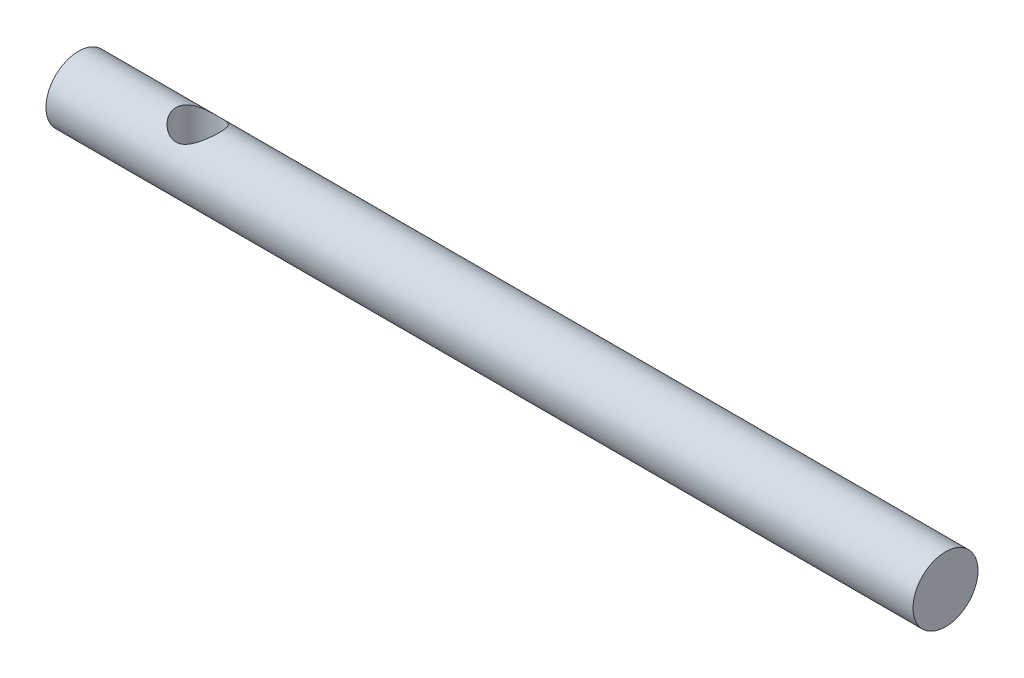
ISO-10303-21;
HEADER;
FILE_DESCRIPTION(('STEP AP214'),'2;1');
FILE_NAME('part.step','',(''),(''),'','','');
FILE_SCHEMA(('AUTOMOTIVE_DESIGN { 1 0 10303 214 1 1 1 1 }'));
ENDSEC;
DATA;
#1=APPLICATION_CONTEXT('core data for automotive mechanical design processes');
#2=APPLICATION_PROTOCOL_DEFINITION('international standard','automotive_design',2000,#1);
#3=PRODUCT_CONTEXT('',#1,'mechanical');
#4=PRODUCT('Part','Part','',(#3));
#5=PRODUCT_RELATED_PRODUCT_CATEGORY('part','',(#4));
#6=PRODUCT_DEFINITION_FORMATION('','',#4);
#7=PRODUCT_DEFINITION_CONTEXT('part definition',#1,'design');
#8=PRODUCT_DEFINITION('design','',#6,#7);
#9=PRODUCT_DEFINITION_SHAPE('','',#8);
#10=(LENGTH_UNIT() NAMED_UNIT(*) SI_UNIT(.MILLI.,.METRE.));
#11=(NAMED_UNIT(*) PLANE_ANGLE_UNIT() SI_UNIT($,.RADIAN.));
#12=(NAMED_UNIT(*) SI_UNIT($,.STERADIAN.) SOLID_ANGLE_UNIT());
#13=UNCERTAINTY_MEASURE_WITH_UNIT(LENGTH_MEASURE(1.E-05),#10,'distance_accuracy_value','');
#14=(GEOMETRIC_REPRESENTATION_CONTEXT(3) GLOBAL_UNCERTAINTY_ASSIGNED_CONTEXT((#13)) GLOBAL_UNIT_ASSIGNED_CONTEXT((#10,
#11,#12)) REPRESENTATION_CONTEXT('',''));
#15=CARTESIAN_POINT('',(0.,0.,0.));
#16=DIRECTION('',(0.,0.,1.));
#17=DIRECTION('',(1.,0.,0.));
#18=AXIS2_PLACEMENT_3D('',#15,#16,#17);
#19=CARTESIAN_POINT('',(40.,0.,0.));
#20=DIRECTION('',(-1.,0.,0.));
#21=DIRECTION('',(0.,0.,1.));
#22=AXIS2_PLACEMENT_3D('',#19,#20,#21);
#23=CYLINDRICAL_SURFACE('',#22,1.5);
#24=CARTESIAN_POINT('',(4.5,-1.5,0.));
#25=CARTESIAN_POINT('',(4.49999972518375,-1.50000020822414,0.050242358334064));
#26=CARTESIAN_POINT('',(4.50380698497775,-1.49745401376693,0.100484543566457));
#27=CARTESIAN_POINT('',(4.51879843205283,-1.48752326211906,0.199366529015833));
#28=CARTESIAN_POINT('',(4.52998612156165,-1.48013640790618,0.248005556977501));
#29=CARTESIAN_POINT('',(4.55905385866242,-1.46125241202354,0.342106153927126));
#30=CARTESIAN_POINT('',(4.57690257000397,-1.44977452746657,0.387581436328777));
#31=CARTESIAN_POINT('',(4.61853168163575,-1.4236306893872,0.474707645498629));
#32=CARTESIAN_POINT('',(4.64231294315028,-1.40896427302755,0.516358015804834));
#33=CARTESIAN_POINT('',(4.69732846868371,-1.37613664684919,0.598642350385054));
#34=CARTESIAN_POINT('',(4.72902393037145,-1.3577844878966,0.638890152730337));
#35=CARTESIAN_POINT('',(4.79786502432922,-1.31991156541733,0.713864022346369));
#36=CARTESIAN_POINT('',(4.83501846491887,-1.30038915178416,0.748582027719439));
#37=CARTESIAN_POINT('',(4.92052618380634,-1.25864132339397,0.81711148872748));
#38=CARTESIAN_POINT('',(4.96972282660172,-1.23647533968899,0.849915931813755));
#39=CARTESIAN_POINT('',(5.07418168882327,-1.19542073676408,0.906751785070868));
#40=CARTESIAN_POINT('',(5.12943320078139,-1.17652647977327,0.930798367132494));
#41=CARTESIAN_POINT('',(5.2283556467108,-1.14988133320735,0.963370175057203));
#42=CARTESIAN_POINT('',(5.27076422643691,-1.14048813946218,0.974372236180082));
#43=CARTESIAN_POINT('',(5.35737225237087,-1.12628984829786,0.9907530889261));
#44=CARTESIAN_POINT('',(5.40156847436319,-1.12147684372013,0.99614157325966));
#45=CARTESIAN_POINT('',(5.49073738942807,-1.11718302804083,1.00095682070629));
#46=CARTESIAN_POINT('',(5.5357125117256,-1.11772401279478,1.0003592145882));
#47=CARTESIAN_POINT('',(5.62481748675048,-1.12409887741485,0.993187906666195));
#48=CARTESIAN_POINT('',(5.66894659101632,-1.12993724142592,0.986609141899784));
#49=CARTESIAN_POINT('',(5.75323352561879,-1.14563592995791,0.968324971088712));
#50=CARTESIAN_POINT('',(5.79348066796153,-1.15530744165153,0.956858557405003));
#51=CARTESIAN_POINT('',(5.87151184549575,-1.17754811463845,0.929350592909501));
#52=CARTESIAN_POINT('',(5.90929506514863,-1.19011822916388,0.913307536614354));
#53=CARTESIAN_POINT('',(5.98951269764114,-1.21982098202212,0.873369093698318));
#54=CARTESIAN_POINT('',(6.03132995009406,-1.23736158924507,0.848540261643842));
#55=CARTESIAN_POINT('',(6.11069169749191,-1.27345768922483,0.793344802336528));
#56=CARTESIAN_POINT('',(6.14823082883713,-1.29201441370947,0.762971345040336));
#57=CARTESIAN_POINT('',(6.22627127285557,-1.33271671862096,0.689905826559709));
#58=CARTESIAN_POINT('',(6.2656670243557,-1.35477372355024,0.645969691404497));
#59=CARTESIAN_POINT('',(6.33659824725494,-1.39609050337857,0.551003999553807));
#60=CARTESIAN_POINT('',(6.36814107270105,-1.41535288825285,0.499981149675161));
#61=CARTESIAN_POINT('',(6.4167388593142,-1.44572702044166,0.402428913545598));
#62=CARTESIAN_POINT('',(6.43542168167021,-1.45769630582498,0.356978821685239));
#63=CARTESIAN_POINT('',(6.46605246281194,-1.47753859515521,0.263018021968452));
#64=CARTESIAN_POINT('',(6.47800611356591,-1.48541506063844,0.214509939501016));
#65=CARTESIAN_POINT('',(6.4945805826192,-1.49637941078331,0.115492726585946));
#66=CARTESIAN_POINT('',(6.49916973046918,-1.49944661230576,0.0649759059670216));
#67=CARTESIAN_POINT('',(6.50062354428105,-1.50041557482591,-0.0362207596946188));
#68=CARTESIAN_POINT('',(6.49748875024439,-1.49831769692815,-0.0869005930932838));
#69=CARTESIAN_POINT('',(6.48418797221902,-1.48949794712138,-0.183227858602149));
#70=CARTESIAN_POINT('',(6.47453135112234,-1.48311123195135,-0.228978722339657));
#71=CARTESIAN_POINT('',(6.44920215699362,-1.46659224642396,-0.318058196213642));
#72=CARTESIAN_POINT('',(6.4335286245361,-1.45645937873408,-0.361386418785357));
#73=CARTESIAN_POINT('',(6.39567385147732,-1.4324817626467,-0.447332375233223));
#74=CARTESIAN_POINT('',(6.37315592295824,-1.41844935068245,-0.489748092316565));
#75=CARTESIAN_POINT('',(6.32278335502769,-1.38800927805403,-0.570341511977791));
#76=CARTESIAN_POINT('',(6.29492541973703,-1.37160015200651,-0.608516574097257));
#77=CARTESIAN_POINT('',(6.22969606591763,-1.33477273328243,-0.685927227415324));
#78=CARTESIAN_POINT('',(6.19151686994798,-1.31413078406203,-0.724375937862666));
#79=CARTESIAN_POINT('',(6.10944428503593,-1.27285586536854,-0.794669840332393));
#80=CARTESIAN_POINT('',(6.0655469805006,-1.25222291185946,-0.826510468230435));
#81=CARTESIAN_POINT('',(5.9764287935708,-1.21469839506517,-0.880623882794764));
#82=CARTESIAN_POINT('',(5.93163398310014,-1.19763798588661,-0.903478180804395));
#83=CARTESIAN_POINT('',(5.83806367360943,-1.16719487207113,-0.942481068876251));
#84=CARTESIAN_POINT('',(5.7892955308023,-1.1538055628277,-0.958641728453859));
#85=CARTESIAN_POINT('',(5.69771775643295,-1.13466604076532,-0.981179217293119));
#86=CARTESIAN_POINT('',(5.65541409507053,-1.12797499006895,-0.988792987823092));
#87=CARTESIAN_POINT('',(5.56971335933228,-1.11939733222928,-0.998496029624887));
#88=CARTESIAN_POINT('',(5.52631752442676,-1.11750550674066,-1.00059130142516));
#89=CARTESIAN_POINT('',(5.43967847164164,-1.11882100574833,-0.999119609907756));
#90=CARTESIAN_POINT('',(5.39643535931854,-1.12203134956834,-0.995549293852656));
#91=CARTESIAN_POINT('',(5.31132823572851,-1.1330522619864,-0.98298498610997));
#92=CARTESIAN_POINT('',(5.26946614306961,-1.14086896751217,-0.973983758587649));
#93=CARTESIAN_POINT('',(5.17714440678568,-1.1626342196827,-0.947965178356307));
#94=CARTESIAN_POINT('',(5.12736614363046,-1.17766166854602,-0.929450935941992));
#95=CARTESIAN_POINT('',(5.03225658291059,-1.21111080629161,-0.885422631474872));
#96=CARTESIAN_POINT('',(4.98693165103157,-1.22953724861883,-0.859898741785419));
#97=CARTESIAN_POINT('',(4.90035905640316,-1.26808593269726,-0.801991402694656));
#98=CARTESIAN_POINT('',(4.85920062728074,-1.28823293691071,-0.76949154944827));
#99=CARTESIAN_POINT('',(4.78233876087877,-1.32814150773993,-0.698358840177307));
#100=CARTESIAN_POINT('',(4.74663700148759,-1.3479029541764,-0.659724105134949));
#101=CARTESIAN_POINT('',(4.67664394784294,-1.38815775980392,-0.570728664877767));
#102=CARTESIAN_POINT('',(4.64329067991017,-1.40834902724558,-0.519480834775985));
#103=CARTESIAN_POINT('',(4.58604336166801,-1.44388832937518,-0.410434277887487));
#104=CARTESIAN_POINT('',(4.56213444658818,-1.45924396722731,-0.35264603122502));
#105=CARTESIAN_POINT('',(4.52942271091798,-1.48050822418367,-0.245717534917523));
#106=CARTESIAN_POINT('',(4.51844448045066,-1.48775740184446,-0.197506162628865));
#107=CARTESIAN_POINT('',(4.50373598373098,-1.49750140070948,-0.0995290060120643));
#108=CARTESIAN_POINT('',(4.500000272202,-1.49999979375663,-0.0497644180940282));
#109=CARTESIAN_POINT('',(4.5,-1.5,0.));
#110=B_SPLINE_CURVE_WITH_KNOTS('',3,(#24,#25,#26,#27,#28,#29,#30,#31,#32,#33,#34,#35,#36,#37,
#38,#39,#40,#41,#42,#43,#44,#45,#46,#47,#48,#49,#50,#51,#52,#53,#54,#55,#56,#57,#58,#59,#60,#61,
#62,#63,#64,#65,#66,#67,#68,#69,#70,#71,#72,#73,#74,#75,#76,#77,#78,#79,#80,#81,#82,#83,#84,#85,
#86,#87,#88,#89,#90,#91,#92,#93,#94,#95,#96,#97,#98,#99,#100,#101,#102,#103,#104,#105,#106,#107,
#108,#109),.UNSPECIFIED.,.T.,.F.,(4,2,2,2,2,2,2,2,2,2,2,2,2,2,2,2,2,2,2,2,2,2,2,2,2,2,2,2,2,2,2,
2,2,2,2,2,2,2,2,2,2,2,4),(0.,0.1505266132527,0.301124707174344,0.451023076595115,
0.600943219336932,0.763585145002783,0.926462058021592,1.11503341647991,1.30327652722719,
1.43716846838015,1.57082883922904,1.70503355867689,1.83935198631676,1.96774431099011,
2.09617891902539,2.25073787329797,2.40548851889213,2.5935947724756,2.78152420149865,
2.93262043847563,3.08358867570591,3.23520441646309,3.38680955765891,3.5277654239542,
3.66874377568319,3.81826173413942,3.96787227471786,4.1411408806983,4.31452876587063,
4.47324967649701,4.63168313315306,4.76162024003012,4.8914160016149,5.02128860137218,
5.15133461921144,5.31603304346011,5.48096356682587,5.64889622595852,5.81688041978686,
6.00897675773024,6.20076953274023,6.34997645676982,6.49907115623393),.UNSPECIFIED.);
#111=CARTESIAN_POINT('',(4.5,-1.5,0.));
#112=VERTEX_POINT('',#111);
#113=EDGE_CURVE('E10',#112,#112,#110,.T.);
#114=ORIENTED_EDGE('',*,*,#113,.T.);
#115=EDGE_LOOP('',(#114));
#116=FACE_BOUND('',#115,.T.);
#117=CARTESIAN_POINT('',(5.5,1.1180339887499,1.));
#118=CARTESIAN_POINT('',(5.45118584456569,1.11803876731408,0.999997269988655));
#119=CARTESIAN_POINT('',(5.4023546231456,1.12129035523721,0.99639496251832));
#120=CARTESIAN_POINT('',(5.30644004417459,1.13365986250809,0.982291341588654));
#121=CARTESIAN_POINT('',(5.25935998223522,1.14278830406355,0.971777652939311));
#122=CARTESIAN_POINT('',(5.16863227906116,1.16528292912785,0.944679308383159));
#123=CARTESIAN_POINT('',(5.12495615163117,1.17860780897301,0.928153590071069));
#124=CARTESIAN_POINT('',(5.04106708382667,1.20792047340913,0.889670041967691));
#125=CARTESIAN_POINT('',(5.00085486501176,1.22390881079415,0.867711084060814));
#126=CARTESIAN_POINT('',(4.91817655619155,1.25973036466013,0.815012050038568));
#127=CARTESIAN_POINT('',(4.8763339411414,1.27977468045182,0.783437177258661));
#128=CARTESIAN_POINT('',(4.79799864556286,1.31972413654041,0.714096098703399));
#129=CARTESIAN_POINT('',(4.76151123917074,1.33962912148992,0.6763238658854));
#130=CARTESIAN_POINT('',(4.68967817060917,1.38044409261874,0.589078452471477));
#131=CARTESIAN_POINT('',(4.65525874411216,1.40108392923461,0.538703219829095));
#132=CARTESIAN_POINT('',(4.59567895225496,1.43779242241382,0.431235482106116));
#133=CARTESIAN_POINT('',(4.57050824298441,1.45386618115518,0.374150576160852));
#134=CARTESIAN_POINT('',(4.53322179949127,1.47799953732363,0.261624536740001));
#135=CARTESIAN_POINT('',(4.51995832775222,1.48675587807934,0.206717362590708));
#136=CARTESIAN_POINT('',(4.50290775535818,1.49804872730961,0.0948477243649306));
#137=CARTESIAN_POINT('',(4.49910872038728,1.5005930688118,0.0378879406429121));
#138=CARTESIAN_POINT('',(4.50108622497453,1.49927680861477,-0.0670735251161652));
#139=CARTESIAN_POINT('',(4.50549452565853,1.49633132455064,-0.115120319004377));
#140=CARTESIAN_POINT('',(4.52104552567945,1.4860409139501,-0.209619316635508));
#141=CARTESIAN_POINT('',(4.53218871615177,1.47869566656551,-0.256071403824862));
#142=CARTESIAN_POINT('',(4.56059784239729,1.46026045851868,-0.346038968835585));
#143=CARTESIAN_POINT('',(4.57783944259928,1.44918538991339,-0.389565311922981));
#144=CARTESIAN_POINT('',(4.61777682147641,1.42410552238144,-0.473104575326778));
#145=CARTESIAN_POINT('',(4.64047359575076,1.41010018872581,-0.513116852484702));
#146=CARTESIAN_POINT('',(4.69398936872995,1.37809029225351,-0.59414214598172));
#147=CARTESIAN_POINT('',(4.72548376167639,1.35980204396012,-0.634595740498539));
#148=CARTESIAN_POINT('',(4.79394933974016,1.32200300913499,-0.709994037491523));
#149=CARTESIAN_POINT('',(4.83092897296691,1.30249036407615,-0.744930067597285));
#150=CARTESIAN_POINT('',(4.91598160510665,1.26075022472076,-0.813861176630826));
#151=CARTESIAN_POINT('',(4.96488553985724,1.23857160004468,-0.846867965631777));
#152=CARTESIAN_POINT('',(5.06875491961036,1.19737805415546,-0.904174374727408));
#153=CARTESIAN_POINT('',(5.12370999720697,1.17835785767438,-0.928488593274471));
#154=CARTESIAN_POINT('',(5.22235953103654,1.15131435153449,-0.961663622838891));
#155=CARTESIAN_POINT('',(5.2647966850284,1.1417018228885,-0.972953958737704));
#156=CARTESIAN_POINT('',(5.35151974490846,1.1270451989479,-0.989897777900029));
#157=CARTESIAN_POINT('',(5.39580230558647,1.12199318391119,-0.995561034821825));
#158=CARTESIAN_POINT('',(5.48522149322059,1.11723778493745,-1.00089700074453));
#159=CARTESIAN_POINT('',(5.53036098925948,1.11755766933454,-1.00054364876605));
#160=CARTESIAN_POINT('',(5.6198419169781,1.12354940184257,-0.993808148581262));
#161=CARTESIAN_POINT('',(5.66418267205586,1.12922558823607,-0.987421113449806));
#162=CARTESIAN_POINT('',(5.74869470877286,1.14463988751152,-0.969499055937226));
#163=CARTESIAN_POINT('',(5.78896385449378,1.15416593537715,-0.958230872657145));
#164=CARTESIAN_POINT('',(5.86706311803266,1.17614979263984,-0.931115208135282));
#165=CARTESIAN_POINT('',(5.9048924115095,1.18860858636727,-0.915266188999618));
#166=CARTESIAN_POINT('',(5.98510100188837,1.21805741810736,-0.875816733031262));
#167=CARTESIAN_POINT('',(6.02687840563095,1.23545540768822,-0.85130014422603));
#168=CARTESIAN_POINT('',(6.10620840116497,1.27131257456476,-0.796763657645589));
#169=CARTESIAN_POINT('',(6.14375575832942,1.2897730248931,-0.766737059459379));
#170=CARTESIAN_POINT('',(6.22198117378524,1.33037839141598,-0.694383288512647));
#171=CARTESIAN_POINT('',(6.26155142413785,1.35244726064259,-0.650801932557861));
#172=CARTESIAN_POINT('',(6.33290834145647,1.39387790925842,-0.556549744344254));
#173=CARTESIAN_POINT('',(6.36470188562506,1.41324207395941,-0.505885238731676));
#174=CARTESIAN_POINT('',(6.41394586946146,1.44395410620132,-0.408743737408332));
#175=CARTESIAN_POINT('',(6.4329782522209,1.45612729055242,-0.363331182442472));
#176=CARTESIAN_POINT('',(6.46430359715951,1.47639353933783,-0.269378539510944));
#177=CARTESIAN_POINT('',(6.47660225142969,1.48449004936067,-0.220841131929568));
#178=CARTESIAN_POINT('',(6.49384848191957,1.49589182013302,-0.121684696151536));
#179=CARTESIAN_POINT('',(6.49876333975339,1.49917575428247,-0.0710574184621091));
#180=CARTESIAN_POINT('',(6.5008239257085,1.50054910514547,0.030427773290317));
#181=CARTESIAN_POINT('',(6.49797037597807,1.49863900469456,0.0812856654767117));
#182=CARTESIAN_POINT('',(6.48517025549766,1.49014777988657,0.177878766264066));
#183=CARTESIAN_POINT('',(6.4757545075691,1.48391638604927,0.223717571535269));
#184=CARTESIAN_POINT('',(6.45088099528455,1.46768053103468,0.313009211498529));
#185=CARTESIAN_POINT('',(6.43542229232637,1.45767548373552,0.356461674343445));
#186=CARTESIAN_POINT('',(6.39803064755799,1.43395882743097,0.442573648304177));
#187=CARTESIAN_POINT('',(6.37577484625246,1.42006624473169,0.485041794600133));
#188=CARTESIAN_POINT('',(6.32592467768701,1.38987704117736,0.565776331341591));
#189=CARTESIAN_POINT('',(6.298327116024,1.37357898322632,0.60404018602501));
#190=CARTESIAN_POINT('',(6.23368554883184,1.33696465736197,0.68164711100701));
#191=CARTESIAN_POINT('',(6.19583848816298,1.31641956938685,0.720213397630456));
#192=CARTESIAN_POINT('',(6.11444322922708,1.27526678824743,0.790800111407978));
#193=CARTESIAN_POINT('',(6.07089080558295,1.25465905985077,0.822815641619616));
#194=CARTESIAN_POINT('',(5.98206620462235,1.21692106795149,0.877566267592056));
#195=CARTESIAN_POINT('',(5.93717909502483,1.19964543370952,0.90082323448605));
#196=CARTESIAN_POINT('',(5.84335777550342,1.16873750795511,0.940579011701362));
#197=CARTESIAN_POINT('',(5.79443165306892,1.15509815647652,0.957090951406666));
#198=CARTESIAN_POINT('',(5.70461426578772,1.1359552596477,0.979681312354539));
#199=CARTESIAN_POINT('',(5.66434588160485,1.12931847705076,0.987261141866241));
#200=CARTESIAN_POINT('',(5.58272179974773,1.12035759608004,0.99741957909463));
#201=CARTESIAN_POINT('',(5.54136702786971,1.11802993920738,1.00000231351858));
#202=CARTESIAN_POINT('',(5.5,1.1180339887499,1.));
#203=B_SPLINE_CURVE_WITH_KNOTS('',3,(#117,#118,#119,#120,#121,#122,#123,#124,#125,#126,#127,
#128,#129,#130,#131,#132,#133,#134,#135,#136,#137,#138,#139,#140,#141,#142,#143,#144,#145,#146,
#147,#148,#149,#150,#151,#152,#153,#154,#155,#156,#157,#158,#159,#160,#161,#162,#163,#164,#165,
#166,#167,#168,#169,#170,#171,#172,#173,#174,#175,#176,#177,#178,#179,#180,#181,#182,#183,#184,
#185,#186,#187,#188,#189,#190,#191,#192,#193,#194,#195,#196,#197,#198,#199,#200,#201,#202),
.UNSPECIFIED.,.T.,.F.,(4,2,2,2,2,2,2,2,2,2,2,2,2,2,2,2,2,2,2,2,2,2,2,2,2,2,2,2,2,2,2,2,2,2,2,2,
2,2,2,2,2,2,4),(0.,0.146253465361077,0.292769521129644,0.437886325608137,0.583033286332746,
0.750773385343188,0.918677592181376,1.11083515503145,1.3027771469429,1.4731874103179,
1.64338268344149,1.78769767477871,1.93202319141873,2.07577915986595,2.219561384515,
2.38223762973317,2.54516707398319,2.73339351752472,2.92130234871974,3.05563045200662,
3.18972483117743,3.32440018819018,3.45918471785299,3.58738225853468,3.71562288822479,
3.86949615025543,4.0235577839993,4.21127342259657,4.39882245285466,4.55035290305024,
4.70175506443411,4.85382614632257,5.00588309222248,5.14688391124039,5.28790663945594,
5.43708931492125,5.58636147964719,5.75911103141432,5.93198925208477,6.09167062897535,
6.25103968323788,6.37508308151303,6.49902399831892),.UNSPECIFIED.);
#204=CARTESIAN_POINT('',(5.5,1.1180339887499,1.));
#205=VERTEX_POINT('',#204);
#206=EDGE_CURVE('E54',#205,#205,#203,.T.);
#207=ORIENTED_EDGE('',*,*,#206,.T.);
#208=EDGE_LOOP('',(#207));
#209=FACE_BOUND('',#208,.T.);
#210=CARTESIAN_POINT('',(40.,0.,0.));
#211=DIRECTION('',(1.,0.,0.));
#212=DIRECTION('',(0.,0.,-1.));
#213=AXIS2_PLACEMENT_3D('',#210,#211,#212);
#214=CIRCLE('',#213,1.5);
#215=CARTESIAN_POINT('',(40.,0.,-1.5));
#216=VERTEX_POINT('',#215);
#217=EDGE_CURVE('E59',#216,#216,#214,.T.);
#218=ORIENTED_EDGE('',*,*,#217,.F.);
#219=EDGE_LOOP('',(#218));
#220=FACE_BOUND('',#219,.T.);
#221=CARTESIAN_POINT('',(0.,0.,0.));
#222=DIRECTION('',(1.,0.,0.));
#223=DIRECTION('',(0.,0.,-1.));
#224=AXIS2_PLACEMENT_3D('',#221,#222,#223);
#225=CIRCLE('',#224,1.5);
#226=CARTESIAN_POINT('',(0.,0.,-1.5));
#227=VERTEX_POINT('',#226);
#228=EDGE_CURVE('E64',#227,#227,#225,.T.);
#229=ORIENTED_EDGE('',*,*,#228,.T.);
#230=EDGE_LOOP('',(#229));
#231=FACE_BOUND('',#230,.T.);
#232=ADVANCED_FACE('F42',(#116,#209,#220,#231),#23,.T.);
#233=CARTESIAN_POINT('',(40.,0.,0.));
#234=DIRECTION('',(1.,0.,0.));
#235=DIRECTION('',(0.,0.,-1.));
#236=AXIS2_PLACEMENT_3D('',#233,#234,#235);
#237=PLANE('',#236);
#238=ORIENTED_EDGE('',*,*,#217,.T.);
#239=EDGE_LOOP('',(#238));
#240=FACE_BOUND('',#239,.T.);
#241=ADVANCED_FACE('F76',(#240),#237,.T.);
#242=CARTESIAN_POINT('',(0.,0.,0.));
#243=DIRECTION('',(1.,0.,0.));
#244=DIRECTION('',(0.,0.,-1.));
#245=AXIS2_PLACEMENT_3D('',#242,#243,#244);
#246=PLANE('',#245);
#247=ORIENTED_EDGE('',*,*,#228,.F.);
#248=EDGE_LOOP('',(#247));
#249=FACE_BOUND('',#248,.T.);
#250=ADVANCED_FACE('F74',(#249),#246,.F.);
#251=CARTESIAN_POINT('',(5.5,-1.5,0.));
#252=DIRECTION('',(0.,1.,0.));
#253=DIRECTION('',(0.,0.,1.));
#254=AXIS2_PLACEMENT_3D('',#251,#252,#253);
#255=CYLINDRICAL_SURFACE('',#254,1.);
#256=ORIENTED_EDGE('',*,*,#206,.F.);
#257=EDGE_LOOP('',(#256));
#258=FACE_BOUND('',#257,.T.);
#259=ORIENTED_EDGE('',*,*,#113,.F.);
#260=EDGE_LOOP('',(#259));
#261=FACE_BOUND('',#260,.T.);
#262=ADVANCED_FACE('F70',(#258,#261),#255,.F.);
#263=CLOSED_SHELL('',(#232,#241,#250,#262));
#264=MANIFOLD_SOLID_BREP('B2',#263);
#265=ADVANCED_BREP_SHAPE_REPRESENTATION('',(#18,#264),#14);
#266=SHAPE_DEFINITION_REPRESENTATION(#9,#265);
ENDSEC;
END-ISO-10303-21;
